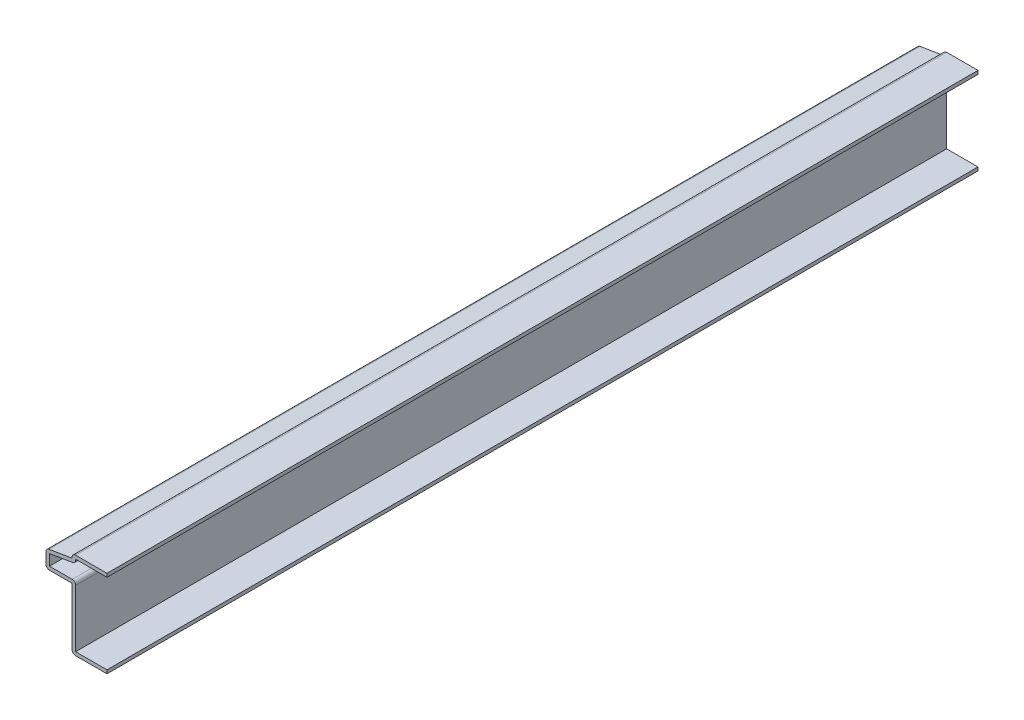
ISO-10303-21;
HEADER;
FILE_DESCRIPTION(('STEP AP214'),'2;1');
FILE_NAME('part.step','',(''),(''),'','','');
FILE_SCHEMA(('AUTOMOTIVE_DESIGN { 1 0 10303 214 1 1 1 1 }'));
ENDSEC;
DATA;
#1=APPLICATION_CONTEXT('core data for automotive mechanical design processes');
#2=APPLICATION_PROTOCOL_DEFINITION('international standard','automotive_design',2000,#1);
#3=PRODUCT_CONTEXT('',#1,'mechanical');
#4=PRODUCT('Part','Part','',(#3));
#5=PRODUCT_RELATED_PRODUCT_CATEGORY('part','',(#4));
#6=PRODUCT_DEFINITION_FORMATION('','',#4);
#7=PRODUCT_DEFINITION_CONTEXT('part definition',#1,'design');
#8=PRODUCT_DEFINITION('design','',#6,#7);
#9=PRODUCT_DEFINITION_SHAPE('','',#8);
#10=(LENGTH_UNIT() NAMED_UNIT(*) SI_UNIT(.MILLI.,.METRE.));
#11=(NAMED_UNIT(*) PLANE_ANGLE_UNIT() SI_UNIT($,.RADIAN.));
#12=(NAMED_UNIT(*) SI_UNIT($,.STERADIAN.) SOLID_ANGLE_UNIT());
#13=UNCERTAINTY_MEASURE_WITH_UNIT(LENGTH_MEASURE(1.E-05),#10,'distance_accuracy_value','');
#14=(GEOMETRIC_REPRESENTATION_CONTEXT(3) GLOBAL_UNCERTAINTY_ASSIGNED_CONTEXT((#13)) GLOBAL_UNIT_ASSIGNED_CONTEXT((#10,
#11,#12)) REPRESENTATION_CONTEXT('',''));
#15=CARTESIAN_POINT('',(0.,0.,0.));
#16=DIRECTION('',(0.,0.,1.));
#17=DIRECTION('',(1.,0.,0.));
#18=AXIS2_PLACEMENT_3D('',#15,#16,#17);
#19=CARTESIAN_POINT('',(-12.7,30.48,-317.5));
#20=DIRECTION('',(0.,-1.,0.));
#21=DIRECTION('',(0.,0.,-1.));
#22=AXIS2_PLACEMENT_3D('',#19,#20,#21);
#23=PLANE('',#22);
#24=DIRECTION('',(1.,0.,0.));
#25=VECTOR('',#24,1.);
#26=CARTESIAN_POINT('',(-12.7,30.48,0.));
#27=LINE('',#26,#25);
#28=CARTESIAN_POINT('',(-11.43,30.48,0.));
#29=VERTEX_POINT('',#28);
#30=CARTESIAN_POINT('',(0.,30.48,0.));
#31=VERTEX_POINT('',#30);
#32=EDGE_CURVE('E246',#29,#31,#27,.T.);
#33=ORIENTED_EDGE('',*,*,#32,.F.);
#34=DIRECTION('',(0.,0.,1.));
#35=VECTOR('',#34,1.);
#36=CARTESIAN_POINT('',(-11.43,30.48,-317.5));
#37=LINE('',#36,#35);
#38=CARTESIAN_POINT('',(-11.43,30.48,-317.5));
#39=VERTEX_POINT('',#38);
#40=EDGE_CURVE('E208',#39,#29,#37,.T.);
#41=ORIENTED_EDGE('',*,*,#40,.F.);
#42=DIRECTION('',(1.,0.,0.));
#43=VECTOR('',#42,1.);
#44=CARTESIAN_POINT('',(-12.7,30.48,-317.5));
#45=LINE('',#44,#43);
#46=CARTESIAN_POINT('',(0.,30.48,-317.5));
#47=VERTEX_POINT('',#46);
#48=EDGE_CURVE('E189',#39,#47,#45,.T.);
#49=ORIENTED_EDGE('',*,*,#48,.T.);
#50=DIRECTION('',(0.,0.,1.));
#51=VECTOR('',#50,1.);
#52=CARTESIAN_POINT('',(0.,30.48,-317.5));
#53=LINE('',#52,#51);
#54=EDGE_CURVE('E196',#47,#31,#53,.T.);
#55=ORIENTED_EDGE('',*,*,#54,.T.);
#56=EDGE_LOOP('',(#33,#41,#49,#55));
#57=FACE_BOUND('',#56,.T.);
#58=ADVANCED_FACE('F35',(#57),#23,.T.);
#59=CARTESIAN_POINT('',(-11.43,30.1625,-317.5));
#60=DIRECTION('',(1.,0.,0.));
#61=DIRECTION('',(0.,0.,-1.));
#62=AXIS2_PLACEMENT_3D('',#59,#60,#61);
#63=PLANE('',#62);
#64=DIRECTION('',(0.,1.,0.));
#65=VECTOR('',#64,1.);
#66=CARTESIAN_POINT('',(-11.43,30.1625,0.));
#67=LINE('',#66,#65);
#68=CARTESIAN_POINT('',(-11.43,30.1625,0.));
#69=VERTEX_POINT('',#68);
#70=EDGE_CURVE('E209',#69,#29,#67,.T.);
#71=ORIENTED_EDGE('',*,*,#70,.F.);
#72=DIRECTION('',(0.,0.,1.));
#73=VECTOR('',#72,1.);
#74=CARTESIAN_POINT('',(-11.43,30.1625,-317.5));
#75=LINE('',#74,#73);
#76=CARTESIAN_POINT('',(-11.43,30.1625,-317.5));
#77=VERTEX_POINT('',#76);
#78=EDGE_CURVE('E344',#69,#77,#75,.F.);
#79=ORIENTED_EDGE('',*,*,#78,.T.);
#80=DIRECTION('',(0.,1.,0.));
#81=VECTOR('',#80,1.);
#82=CARTESIAN_POINT('',(-11.43,30.1625,-317.5));
#83=LINE('',#82,#81);
#84=EDGE_CURVE('E204',#77,#39,#83,.T.);
#85=ORIENTED_EDGE('',*,*,#84,.T.);
#86=ORIENTED_EDGE('',*,*,#40,.T.);
#87=EDGE_LOOP('',(#71,#79,#85,#86));
#88=FACE_BOUND('',#87,.T.);
#89=ADVANCED_FACE('F361',(#88),#63,.T.);
#90=CARTESIAN_POINT('',(-22.0162132861222,27.3222797167332,-317.5));
#91=DIRECTION('',(0.164398987305358,-0.986393923832144,0.));
#92=DIRECTION('',(0.986393923832144,0.164398987305358,0.));
#93=AXIS2_PLACEMENT_3D('',#90,#91,#92);
#94=PLANE('',#93);
#95=DIRECTION('',(0.986393923832144,0.164398987305358,0.));
#96=VECTOR('',#95,1.);
#97=CARTESIAN_POINT('',(-22.0162132861222,27.3222797167332,-317.5));
#98=LINE('',#97,#96);
#99=CARTESIAN_POINT('',(-20.955,27.4991485977535,-317.5));
#100=VERTEX_POINT('',#99);
#101=CARTESIAN_POINT('',(-12.4912132861222,28.9097797167332,-317.5));
#102=VERTEX_POINT('',#101);
#103=EDGE_CURVE('E242',#100,#102,#98,.T.);
#104=ORIENTED_EDGE('',*,*,#103,.T.);
#105=DIRECTION('',(0.,0.,1.));
#106=VECTOR('',#105,1.);
#107=CARTESIAN_POINT('',(-12.4912132861222,28.9097797167332,-317.5));
#108=LINE('',#107,#106);
#109=CARTESIAN_POINT('',(-12.4912132861222,28.9097797167332,0.));
#110=VERTEX_POINT('',#109);
#111=EDGE_CURVE('E341',#102,#110,#108,.T.);
#112=ORIENTED_EDGE('',*,*,#111,.T.);
#113=DIRECTION('',(0.986393923832144,0.164398987305358,0.));
#114=VECTOR('',#113,1.);
#115=CARTESIAN_POINT('',(-22.0162132861222,27.3222797167332,0.));
#116=LINE('',#115,#114);
#117=CARTESIAN_POINT('',(-20.955,27.4991485977535,0.));
#118=VERTEX_POINT('',#117);
#119=EDGE_CURVE('E211',#118,#110,#116,.T.);
#120=ORIENTED_EDGE('',*,*,#119,.F.);
#121=DIRECTION('',(0.,0.,1.));
#122=VECTOR('',#121,1.);
#123=CARTESIAN_POINT('',(-20.955,27.4991485977535,-317.5));
#124=LINE('',#123,#122);
#125=EDGE_CURVE('E283',#100,#118,#124,.T.);
#126=ORIENTED_EDGE('',*,*,#125,.F.);
#127=EDGE_LOOP('',(#104,#112,#120,#126));
#128=FACE_BOUND('',#127,.T.);
#129=ADVANCED_FACE('F369',(#128),#94,.T.);
#130=CARTESIAN_POINT('',(-20.955,22.225,-317.5));
#131=DIRECTION('',(1.,0.,0.));
#132=DIRECTION('',(0.,0.,-1.));
#133=AXIS2_PLACEMENT_3D('',#130,#131,#132);
#134=PLANE('',#133);
#135=DIRECTION('',(0.,1.,0.));
#136=VECTOR('',#135,1.);
#137=CARTESIAN_POINT('',(-20.955,22.225,0.));
#138=LINE('',#137,#136);
#139=CARTESIAN_POINT('',(-20.955,23.495,0.));
#140=VERTEX_POINT('',#139);
#141=EDGE_CURVE('E276',#140,#118,#138,.T.);
#142=ORIENTED_EDGE('',*,*,#141,.F.);
#143=DIRECTION('',(0.,0.,1.));
#144=VECTOR('',#143,1.);
#145=CARTESIAN_POINT('',(-20.955,23.495,-317.5));
#146=LINE('',#145,#144);
#147=CARTESIAN_POINT('',(-20.955,23.495,-317.5));
#148=VERTEX_POINT('',#147);
#149=EDGE_CURVE('E285',#148,#140,#146,.T.);
#150=ORIENTED_EDGE('',*,*,#149,.F.);
#151=DIRECTION('',(0.,1.,0.));
#152=VECTOR('',#151,1.);
#153=CARTESIAN_POINT('',(-20.955,22.225,-317.5));
#154=LINE('',#153,#152);
#155=EDGE_CURVE('E239',#148,#100,#154,.T.);
#156=ORIENTED_EDGE('',*,*,#155,.T.);
#157=ORIENTED_EDGE('',*,*,#125,.T.);
#158=EDGE_LOOP('',(#142,#150,#156,#157));
#159=FACE_BOUND('',#158,.T.);
#160=ADVANCED_FACE('F374',(#159),#134,.T.);
#161=CARTESIAN_POINT('',(-12.7,23.495,-317.5));
#162=DIRECTION('',(0.,1.,0.));
#163=DIRECTION('',(0.,0.,1.));
#164=AXIS2_PLACEMENT_3D('',#161,#162,#163);
#165=PLANE('',#164);
#166=DIRECTION('',(1.,0.,0.));
#167=VECTOR('',#166,1.);
#168=CARTESIAN_POINT('',(-12.7,23.495,0.));
#169=LINE('',#168,#167);
#170=CARTESIAN_POINT('',(-12.7,23.495,0.));
#171=VERTEX_POINT('',#170);
#172=EDGE_CURVE('E274',#171,#140,#169,.F.);
#173=ORIENTED_EDGE('',*,*,#172,.F.);
#174=DIRECTION('',(0.,0.,1.));
#175=VECTOR('',#174,1.);
#176=CARTESIAN_POINT('',(-12.7,23.495,-317.5));
#177=LINE('',#176,#175);
#178=CARTESIAN_POINT('',(-12.7,23.495,-317.5));
#179=VERTEX_POINT('',#178);
#180=EDGE_CURVE('E339',#171,#179,#177,.F.);
#181=ORIENTED_EDGE('',*,*,#180,.T.);
#182=DIRECTION('',(1.,0.,0.));
#183=VECTOR('',#182,1.);
#184=CARTESIAN_POINT('',(-12.7,23.495,-317.5));
#185=LINE('',#184,#183);
#186=EDGE_CURVE('E237',#179,#148,#185,.F.);
#187=ORIENTED_EDGE('',*,*,#186,.T.);
#188=ORIENTED_EDGE('',*,*,#149,.T.);
#189=EDGE_LOOP('',(#173,#181,#187,#188));
#190=FACE_BOUND('',#189,.T.);
#191=ADVANCED_FACE('F576',(#190),#165,.T.);
#192=CARTESIAN_POINT('',(-11.43,0.,-317.5));
#193=DIRECTION('',(1.,0.,0.));
#194=DIRECTION('',(0.,0.,-1.));
#195=AXIS2_PLACEMENT_3D('',#192,#193,#194);
#196=PLANE('',#195);
#197=DIRECTION('',(0.,1.,0.));
#198=VECTOR('',#197,1.);
#199=CARTESIAN_POINT('',(-11.43,0.,-317.5));
#200=LINE('',#199,#198);
#201=CARTESIAN_POINT('',(-11.43,1.27,-317.5));
#202=VERTEX_POINT('',#201);
#203=CARTESIAN_POINT('',(-11.43,22.225,-317.5));
#204=VERTEX_POINT('',#203);
#205=EDGE_CURVE('E234',#202,#204,#200,.T.);
#206=ORIENTED_EDGE('',*,*,#205,.T.);
#207=DIRECTION('',(0.,0.,1.));
#208=VECTOR('',#207,1.);
#209=CARTESIAN_POINT('',(-11.43,22.225,-317.5));
#210=LINE('',#209,#208);
#211=CARTESIAN_POINT('',(-11.43,22.225,0.));
#212=VERTEX_POINT('',#211);
#213=EDGE_CURVE('E336',#204,#212,#210,.T.);
#214=ORIENTED_EDGE('',*,*,#213,.T.);
#215=DIRECTION('',(0.,1.,0.));
#216=VECTOR('',#215,1.);
#217=CARTESIAN_POINT('',(-11.43,0.,0.));
#218=LINE('',#217,#216);
#219=CARTESIAN_POINT('',(-11.43,1.27,0.));
#220=VERTEX_POINT('',#219);
#221=EDGE_CURVE('E271',#220,#212,#218,.T.);
#222=ORIENTED_EDGE('',*,*,#221,.F.);
#223=DIRECTION('',(0.,0.,1.));
#224=VECTOR('',#223,1.);
#225=CARTESIAN_POINT('',(-11.43,1.27,-317.5));
#226=LINE('',#225,#224);
#227=EDGE_CURVE('E288',#202,#220,#226,.T.);
#228=ORIENTED_EDGE('',*,*,#227,.F.);
#229=EDGE_LOOP('',(#206,#214,#222,#228));
#230=FACE_BOUND('',#229,.T.);
#231=ADVANCED_FACE('F386',(#230),#196,.T.);
#232=CARTESIAN_POINT('',(0.,1.27,-317.5));
#233=DIRECTION('',(0.,1.,0.));
#234=DIRECTION('',(-1.,0.,0.));
#235=AXIS2_PLACEMENT_3D('',#232,#233,#234);
#236=PLANE('',#235);
#237=DIRECTION('',(-1.,0.,0.));
#238=VECTOR('',#237,1.);
#239=CARTESIAN_POINT('',(0.,1.27,0.));
#240=LINE('',#239,#238);
#241=CARTESIAN_POINT('',(0.,1.27,0.));
#242=VERTEX_POINT('',#241);
#243=EDGE_CURVE('E268',#242,#220,#240,.T.);
#244=ORIENTED_EDGE('',*,*,#243,.F.);
#245=DIRECTION('',(0.,0.,1.));
#246=VECTOR('',#245,1.);
#247=CARTESIAN_POINT('',(0.,1.27,-317.5));
#248=LINE('',#247,#246);
#249=CARTESIAN_POINT('',(0.,1.27,-317.5));
#250=VERTEX_POINT('',#249);
#251=EDGE_CURVE('E290',#250,#242,#248,.T.);
#252=ORIENTED_EDGE('',*,*,#251,.F.);
#253=DIRECTION('',(-1.,0.,0.));
#254=VECTOR('',#253,1.);
#255=CARTESIAN_POINT('',(0.,1.27,-317.5));
#256=LINE('',#255,#254);
#257=EDGE_CURVE('E231',#250,#202,#256,.T.);
#258=ORIENTED_EDGE('',*,*,#257,.T.);
#259=ORIENTED_EDGE('',*,*,#227,.T.);
#260=EDGE_LOOP('',(#244,#252,#258,#259));
#261=FACE_BOUND('',#260,.T.);
#262=ADVANCED_FACE('F391',(#261),#236,.T.);
#263=CARTESIAN_POINT('',(0.,1.27,-317.5));
#264=DIRECTION('',(-1.,0.,0.));
#265=DIRECTION('',(0.,-1.,0.));
#266=AXIS2_PLACEMENT_3D('',#263,#264,#265);
#267=PLANE('',#266);
#268=DIRECTION('',(0.,-1.,0.));
#269=VECTOR('',#268,1.);
#270=CARTESIAN_POINT('',(0.,1.27,0.));
#271=LINE('',#270,#269);
#272=CARTESIAN_POINT('',(0.,0.,0.));
#273=VERTEX_POINT('',#272);
#274=EDGE_CURVE('E266',#242,#273,#271,.T.);
#275=ORIENTED_EDGE('',*,*,#274,.T.);
#276=DIRECTION('',(0.,0.,1.));
#277=VECTOR('',#276,1.);
#278=CARTESIAN_POINT('',(0.,0.,-317.5));
#279=LINE('',#278,#277);
#280=CARTESIAN_POINT('',(0.,0.,-317.5));
#281=VERTEX_POINT('',#280);
#282=EDGE_CURVE('E292',#281,#273,#279,.T.);
#283=ORIENTED_EDGE('',*,*,#282,.F.);
#284=DIRECTION('',(0.,-1.,0.));
#285=VECTOR('',#284,1.);
#286=CARTESIAN_POINT('',(0.,1.27,-317.5));
#287=LINE('',#286,#285);
#288=EDGE_CURVE('E229',#250,#281,#287,.T.);
#289=ORIENTED_EDGE('',*,*,#288,.F.);
#290=ORIENTED_EDGE('',*,*,#251,.T.);
#291=EDGE_LOOP('',(#275,#283,#289,#290));
#292=FACE_BOUND('',#291,.T.);
#293=ADVANCED_FACE('F398',(#292),#267,.F.);
#294=CARTESIAN_POINT('',(0.,0.,-317.5));
#295=DIRECTION('',(0.,1.,0.));
#296=DIRECTION('',(-1.,0.,0.));
#297=AXIS2_PLACEMENT_3D('',#294,#295,#296);
#298=PLANE('',#297);
#299=DIRECTION('',(-1.,0.,0.));
#300=VECTOR('',#299,1.);
#301=CARTESIAN_POINT('',(0.,0.,0.));
#302=LINE('',#301,#300);
#303=CARTESIAN_POINT('',(-11.43,0.,0.));
#304=VERTEX_POINT('',#303);
#305=EDGE_CURVE('E263',#273,#304,#302,.T.);
#306=ORIENTED_EDGE('',*,*,#305,.T.);
#307=DIRECTION('',(0.,0.,1.));
#308=VECTOR('',#307,1.);
#309=CARTESIAN_POINT('',(-11.43,0.,-317.5));
#310=LINE('',#309,#308);
#311=CARTESIAN_POINT('',(-11.43,0.,-317.5));
#312=VERTEX_POINT('',#311);
#313=EDGE_CURVE('E316',#304,#312,#310,.F.);
#314=ORIENTED_EDGE('',*,*,#313,.T.);
#315=DIRECTION('',(-1.,0.,0.));
#316=VECTOR('',#315,1.);
#317=CARTESIAN_POINT('',(0.,0.,-317.5));
#318=LINE('',#317,#316);
#319=EDGE_CURVE('E227',#281,#312,#318,.T.);
#320=ORIENTED_EDGE('',*,*,#319,.F.);
#321=ORIENTED_EDGE('',*,*,#282,.T.);
#322=EDGE_LOOP('',(#306,#314,#320,#321));
#323=FACE_BOUND('',#322,.T.);
#324=ADVANCED_FACE('F400',(#323),#298,.F.);
#325=CARTESIAN_POINT('',(-12.7,0.,-317.5));
#326=DIRECTION('',(1.,0.,0.));
#327=DIRECTION('',(0.,0.,-1.));
#328=AXIS2_PLACEMENT_3D('',#325,#326,#327);
#329=PLANE('',#328);
#330=DIRECTION('',(0.,1.,0.));
#331=VECTOR('',#330,1.);
#332=CARTESIAN_POINT('',(-12.7,0.,-317.5));
#333=LINE('',#332,#331);
#334=CARTESIAN_POINT('',(-12.7,1.27,-317.5));
#335=VERTEX_POINT('',#334);
#336=CARTESIAN_POINT('',(-12.7,22.225,-317.5));
#337=VERTEX_POINT('',#336);
#338=EDGE_CURVE('E225',#335,#337,#333,.T.);
#339=ORIENTED_EDGE('',*,*,#338,.F.);
#340=DIRECTION('',(0.,0.,1.));
#341=VECTOR('',#340,1.);
#342=CARTESIAN_POINT('',(-12.7,1.27,-317.5));
#343=LINE('',#342,#341);
#344=CARTESIAN_POINT('',(-12.7,1.27,0.));
#345=VERTEX_POINT('',#344);
#346=EDGE_CURVE('E282',#335,#345,#343,.T.);
#347=ORIENTED_EDGE('',*,*,#346,.T.);
#348=DIRECTION('',(0.,1.,0.));
#349=VECTOR('',#348,1.);
#350=CARTESIAN_POINT('',(-12.7,0.,0.));
#351=LINE('',#350,#349);
#352=CARTESIAN_POINT('',(-12.7,22.225,0.));
#353=VERTEX_POINT('',#352);
#354=EDGE_CURVE('E261',#345,#353,#351,.T.);
#355=ORIENTED_EDGE('',*,*,#354,.T.);
#356=DIRECTION('',(0.,0.,1.));
#357=VECTOR('',#356,1.);
#358=CARTESIAN_POINT('',(-12.7,22.225,-317.5));
#359=LINE('',#358,#357);
#360=EDGE_CURVE('E295',#337,#353,#359,.T.);
#361=ORIENTED_EDGE('',*,*,#360,.F.);
#362=EDGE_LOOP('',(#339,#347,#355,#361));
#363=FACE_BOUND('',#362,.T.);
#364=ADVANCED_FACE('F408',(#363),#329,.F.);
#365=CARTESIAN_POINT('',(-12.7,22.225,-317.5));
#366=DIRECTION('',(0.,1.,0.));
#367=DIRECTION('',(0.,0.,1.));
#368=AXIS2_PLACEMENT_3D('',#365,#366,#367);
#369=PLANE('',#368);
#370=DIRECTION('',(-1.,0.,0.));
#371=VECTOR('',#370,1.);
#372=CARTESIAN_POINT('',(-12.7,22.225,0.));
#373=LINE('',#372,#371);
#374=CARTESIAN_POINT('',(-20.955,22.225,0.));
#375=VERTEX_POINT('',#374);
#376=EDGE_CURVE('E258',#353,#375,#373,.T.);
#377=ORIENTED_EDGE('',*,*,#376,.T.);
#378=DIRECTION('',(0.,0.,1.));
#379=VECTOR('',#378,1.);
#380=CARTESIAN_POINT('',(-20.955,22.225,-317.5));
#381=LINE('',#380,#379);
#382=CARTESIAN_POINT('',(-20.955,22.225,-317.5));
#383=VERTEX_POINT('',#382);
#384=EDGE_CURVE('E334',#375,#383,#381,.F.);
#385=ORIENTED_EDGE('',*,*,#384,.T.);
#386=DIRECTION('',(-1.,0.,0.));
#387=VECTOR('',#386,1.);
#388=CARTESIAN_POINT('',(-12.7,22.225,-317.5));
#389=LINE('',#388,#387);
#390=EDGE_CURVE('E222',#337,#383,#389,.T.);
#391=ORIENTED_EDGE('',*,*,#390,.F.);
#392=ORIENTED_EDGE('',*,*,#360,.T.);
#393=EDGE_LOOP('',(#377,#385,#391,#392));
#394=FACE_BOUND('',#393,.T.);
#395=ADVANCED_FACE('F412',(#394),#369,.F.);
#396=CARTESIAN_POINT('',(-22.225,22.225,-317.5));
#397=DIRECTION('',(1.,0.,0.));
#398=DIRECTION('',(0.,0.,-1.));
#399=AXIS2_PLACEMENT_3D('',#396,#397,#398);
#400=PLANE('',#399);
#401=DIRECTION('',(0.,1.,0.));
#402=VECTOR('',#401,1.);
#403=CARTESIAN_POINT('',(-22.225,22.225,-317.5));
#404=LINE('',#403,#402);
#405=CARTESIAN_POINT('',(-22.225,23.495,-317.5));
#406=VERTEX_POINT('',#405);
#407=CARTESIAN_POINT('',(-22.225,27.4991485977535,-317.5));
#408=VERTEX_POINT('',#407);
#409=EDGE_CURVE('E219',#406,#408,#404,.T.);
#410=ORIENTED_EDGE('',*,*,#409,.F.);
#411=DIRECTION('',(0.,0.,1.));
#412=VECTOR('',#411,1.);
#413=CARTESIAN_POINT('',(-22.225,23.495,-317.5));
#414=LINE('',#413,#412);
#415=CARTESIAN_POINT('',(-22.225,23.495,0.));
#416=VERTEX_POINT('',#415);
#417=EDGE_CURVE('E331',#406,#416,#414,.T.);
#418=ORIENTED_EDGE('',*,*,#417,.T.);
#419=DIRECTION('',(0.,1.,0.));
#420=VECTOR('',#419,1.);
#421=CARTESIAN_POINT('',(-22.225,22.225,0.));
#422=LINE('',#421,#420);
#423=CARTESIAN_POINT('',(-22.225,27.4991485977535,0.));
#424=VERTEX_POINT('',#423);
#425=EDGE_CURVE('E255',#416,#424,#422,.T.);
#426=ORIENTED_EDGE('',*,*,#425,.T.);
#427=DIRECTION('',(0.,0.,1.));
#428=VECTOR('',#427,1.);
#429=CARTESIAN_POINT('',(-22.225,27.4991485977535,-317.5));
#430=LINE('',#429,#428);
#431=EDGE_CURVE('E329',#424,#408,#430,.F.);
#432=ORIENTED_EDGE('',*,*,#431,.T.);
#433=EDGE_LOOP('',(#410,#418,#426,#432));
#434=FACE_BOUND('',#433,.T.);
#435=ADVANCED_FACE('F421',(#434),#400,.F.);
#436=CARTESIAN_POINT('',(-22.225,28.575,-317.5));
#437=DIRECTION('',(0.164398987305358,-0.986393923832144,0.));
#438=DIRECTION('',(0.986393923832144,0.164398987305358,0.));
#439=AXIS2_PLACEMENT_3D('',#436,#437,#438);
#440=PLANE('',#439);
#441=DIRECTION('',(0.986393923832144,0.164398987305358,0.));
#442=VECTOR('',#441,1.);
#443=CARTESIAN_POINT('',(-22.225,28.575,-317.5));
#444=LINE('',#443,#442);
#445=CARTESIAN_POINT('',(-21.1637867138778,28.7518688810204,-317.5));
#446=VERTEX_POINT('',#445);
#447=CARTESIAN_POINT('',(-12.7,30.1625,-317.5));
#448=VERTEX_POINT('',#447);
#449=EDGE_CURVE('E217',#446,#448,#444,.T.);
#450=ORIENTED_EDGE('',*,*,#449,.F.);
#451=DIRECTION('',(0.,0.,1.));
#452=VECTOR('',#451,1.);
#453=CARTESIAN_POINT('',(-21.1637867138778,28.7518688810204,-317.5));
#454=LINE('',#453,#452);
#455=CARTESIAN_POINT('',(-21.1637867138778,28.7518688810204,0.));
#456=VERTEX_POINT('',#455);
#457=EDGE_CURVE('E346',#446,#456,#454,.T.);
#458=ORIENTED_EDGE('',*,*,#457,.T.);
#459=DIRECTION('',(0.986393923832144,0.164398987305358,0.));
#460=VECTOR('',#459,1.);
#461=CARTESIAN_POINT('',(-22.225,28.575,0.));
#462=LINE('',#461,#460);
#463=CARTESIAN_POINT('',(-12.7,30.1625,0.));
#464=VERTEX_POINT('',#463);
#465=EDGE_CURVE('E253',#456,#464,#462,.T.);
#466=ORIENTED_EDGE('',*,*,#465,.T.);
#467=DIRECTION('',(0.,0.,1.));
#468=VECTOR('',#467,1.);
#469=CARTESIAN_POINT('',(-12.7,30.1625,-317.5));
#470=LINE('',#469,#468);
#471=EDGE_CURVE('E298',#448,#464,#470,.T.);
#472=ORIENTED_EDGE('',*,*,#471,.F.);
#473=EDGE_LOOP('',(#450,#458,#466,#472));
#474=FACE_BOUND('',#473,.T.);
#475=ADVANCED_FACE('F430',(#474),#440,.F.);
#476=CARTESIAN_POINT('',(-12.7,30.1625,-317.5));
#477=DIRECTION('',(1.,0.,0.));
#478=DIRECTION('',(0.,0.,-1.));
#479=AXIS2_PLACEMENT_3D('',#476,#477,#478);
#480=PLANE('',#479);
#481=DIRECTION('',(0.,1.,0.));
#482=VECTOR('',#481,1.);
#483=CARTESIAN_POINT('',(-12.7,30.1625,0.));
#484=LINE('',#483,#482);
#485=CARTESIAN_POINT('',(-12.7,30.48,0.));
#486=VERTEX_POINT('',#485);
#487=EDGE_CURVE('E251',#464,#486,#484,.T.);
#488=ORIENTED_EDGE('',*,*,#487,.T.);
#489=DIRECTION('',(0.,0.,1.));
#490=VECTOR('',#489,1.);
#491=CARTESIAN_POINT('',(-12.7,30.48,-317.5));
#492=LINE('',#491,#490);
#493=CARTESIAN_POINT('',(-12.7,30.48,-317.5));
#494=VERTEX_POINT('',#493);
#495=EDGE_CURVE('E11',#486,#494,#492,.F.);
#496=ORIENTED_EDGE('',*,*,#495,.T.);
#497=DIRECTION('',(0.,1.,0.));
#498=VECTOR('',#497,1.);
#499=CARTESIAN_POINT('',(-12.7,30.1625,-317.5));
#500=LINE('',#499,#498);
#501=EDGE_CURVE('E215',#448,#494,#500,.T.);
#502=ORIENTED_EDGE('',*,*,#501,.F.);
#503=ORIENTED_EDGE('',*,*,#471,.T.);
#504=EDGE_LOOP('',(#488,#496,#502,#503));
#505=FACE_BOUND('',#504,.T.);
#506=ADVANCED_FACE('F513',(#505),#480,.F.);
#507=CARTESIAN_POINT('',(-12.7,31.75,-317.5));
#508=DIRECTION('',(0.,-1.,0.));
#509=DIRECTION('',(0.,0.,-1.));
#510=AXIS2_PLACEMENT_3D('',#507,#508,#509);
#511=PLANE('',#510);
#512=DIRECTION('',(1.,0.,0.));
#513=VECTOR('',#512,1.);
#514=CARTESIAN_POINT('',(-12.7,31.75,-317.5));
#515=LINE('',#514,#513);
#516=CARTESIAN_POINT('',(-11.43,31.75,-317.5));
#517=VERTEX_POINT('',#516);
#518=CARTESIAN_POINT('',(0.,31.75,-317.5));
#519=VERTEX_POINT('',#518);
#520=EDGE_CURVE('E190',#517,#519,#515,.T.);
#521=ORIENTED_EDGE('',*,*,#520,.F.);
#522=DIRECTION('',(0.,0.,1.));
#523=VECTOR('',#522,1.);
#524=CARTESIAN_POINT('',(-11.43,31.75,-317.5));
#525=LINE('',#524,#523);
#526=CARTESIAN_POINT('',(-11.43,31.75,0.));
#527=VERTEX_POINT('',#526);
#528=EDGE_CURVE('E43',#517,#527,#525,.T.);
#529=ORIENTED_EDGE('',*,*,#528,.T.);
#530=DIRECTION('',(1.,0.,0.));
#531=VECTOR('',#530,1.);
#532=CARTESIAN_POINT('',(-12.7,31.75,0.));
#533=LINE('',#532,#531);
#534=CARTESIAN_POINT('',(0.,31.75,0.));
#535=VERTEX_POINT('',#534);
#536=EDGE_CURVE('E249',#527,#535,#533,.T.);
#537=ORIENTED_EDGE('',*,*,#536,.T.);
#538=DIRECTION('',(0.,0.,1.));
#539=VECTOR('',#538,1.);
#540=CARTESIAN_POINT('',(0.,31.75,-317.5));
#541=LINE('',#540,#539);
#542=EDGE_CURVE('E203',#519,#535,#541,.T.);
#543=ORIENTED_EDGE('',*,*,#542,.F.);
#544=EDGE_LOOP('',(#521,#529,#537,#543));
#545=FACE_BOUND('',#544,.T.);
#546=ADVANCED_FACE('F352',(#545),#511,.F.);
#547=CARTESIAN_POINT('',(0.,31.75,-317.5));
#548=DIRECTION('',(-1.,0.,0.));
#549=DIRECTION('',(0.,0.,1.));
#550=AXIS2_PLACEMENT_3D('',#547,#548,#549);
#551=PLANE('',#550);
#552=DIRECTION('',(0.,-1.,0.));
#553=VECTOR('',#552,1.);
#554=CARTESIAN_POINT('',(0.,31.75,0.));
#555=LINE('',#554,#553);
#556=EDGE_CURVE('E199',#535,#31,#555,.T.);
#557=ORIENTED_EDGE('',*,*,#556,.T.);
#558=ORIENTED_EDGE('',*,*,#54,.F.);
#559=DIRECTION('',(0.,-1.,0.));
#560=VECTOR('',#559,1.);
#561=CARTESIAN_POINT('',(0.,31.75,-317.5));
#562=LINE('',#561,#560);
#563=EDGE_CURVE('E183',#519,#47,#562,.T.);
#564=ORIENTED_EDGE('',*,*,#563,.F.);
#565=ORIENTED_EDGE('',*,*,#542,.T.);
#566=EDGE_LOOP('',(#557,#558,#564,#565));
#567=FACE_BOUND('',#566,.T.);
#568=ADVANCED_FACE('F197',(#567),#551,.F.);
#569=CARTESIAN_POINT('',(0.,0.,-317.5));
#570=DIRECTION('',(0.,0.,-1.));
#571=DIRECTION('',(-1.,0.,0.));
#572=AXIS2_PLACEMENT_3D('',#569,#570,#571);
#573=PLANE('',#572);
#574=ORIENTED_EDGE('',*,*,#319,.T.);
#575=CARTESIAN_POINT('',(-11.43,1.27,-317.5));
#576=DIRECTION('',(0.,0.,-1.));
#577=DIRECTION('',(-1.,0.,0.));
#578=AXIS2_PLACEMENT_3D('',#575,#576,#577);
#579=CIRCLE('',#578,1.27);
#580=EDGE_CURVE('E327',#312,#335,#579,.T.);
#581=ORIENTED_EDGE('',*,*,#580,.T.);
#582=ORIENTED_EDGE('',*,*,#338,.T.);
#583=ORIENTED_EDGE('',*,*,#390,.T.);
#584=CARTESIAN_POINT('',(-20.955,23.495,-317.5));
#585=DIRECTION('',(0.,0.,-1.));
#586=DIRECTION('',(-1.,0.,0.));
#587=AXIS2_PLACEMENT_3D('',#584,#585,#586);
#588=CIRCLE('',#587,1.27);
#589=EDGE_CURVE('E325',#383,#406,#588,.T.);
#590=ORIENTED_EDGE('',*,*,#589,.T.);
#591=ORIENTED_EDGE('',*,*,#409,.T.);
#592=CARTESIAN_POINT('',(-20.955,27.4991485977535,-317.5));
#593=DIRECTION('',(0.,0.,-1.));
#594=DIRECTION('',(-1.,0.,0.));
#595=AXIS2_PLACEMENT_3D('',#592,#593,#594);
#596=CIRCLE('',#595,1.27);
#597=EDGE_CURVE('E319',#408,#446,#596,.T.);
#598=ORIENTED_EDGE('',*,*,#597,.T.);
#599=ORIENTED_EDGE('',*,*,#449,.T.);
#600=ORIENTED_EDGE('',*,*,#501,.T.);
#601=CARTESIAN_POINT('',(-11.43,30.48,-317.5));
#602=DIRECTION('',(0.,0.,-1.));
#603=DIRECTION('',(-1.,0.,0.));
#604=AXIS2_PLACEMENT_3D('',#601,#602,#603);
#605=CIRCLE('',#604,1.27);
#606=EDGE_CURVE('E50',#494,#517,#605,.T.);
#607=ORIENTED_EDGE('',*,*,#606,.T.);
#608=ORIENTED_EDGE('',*,*,#520,.T.);
#609=ORIENTED_EDGE('',*,*,#563,.T.);
#610=ORIENTED_EDGE('',*,*,#48,.F.);
#611=ORIENTED_EDGE('',*,*,#84,.F.);
#612=CARTESIAN_POINT('',(-12.7,30.1625,-317.5));
#613=DIRECTION('',(0.,0.,-1.));
#614=DIRECTION('',(-1.,0.,0.));
#615=AXIS2_PLACEMENT_3D('',#612,#613,#614);
#616=CIRCLE('',#615,1.27);
#617=EDGE_CURVE('E321',#77,#102,#616,.T.);
#618=ORIENTED_EDGE('',*,*,#617,.T.);
#619=ORIENTED_EDGE('',*,*,#103,.F.);
#620=ORIENTED_EDGE('',*,*,#155,.F.);
#621=ORIENTED_EDGE('',*,*,#186,.F.);
#622=CARTESIAN_POINT('',(-12.7,22.225,-317.5));
#623=DIRECTION('',(0.,0.,-1.));
#624=DIRECTION('',(-1.,0.,0.));
#625=AXIS2_PLACEMENT_3D('',#622,#623,#624);
#626=CIRCLE('',#625,1.27);
#627=EDGE_CURVE('E323',#179,#204,#626,.T.);
#628=ORIENTED_EDGE('',*,*,#627,.T.);
#629=ORIENTED_EDGE('',*,*,#205,.F.);
#630=ORIENTED_EDGE('',*,*,#257,.F.);
#631=ORIENTED_EDGE('',*,*,#288,.T.);
#632=EDGE_LOOP('',(#574,#581,#582,#583,#590,#591,#598,#599,#600,#607,#608,#609,#610,#611,#618,
#619,#620,#621,#628,#629,#630,#631));
#633=FACE_BOUND('',#632,.T.);
#634=ADVANCED_FACE('F186',(#633),#573,.T.);
#635=CARTESIAN_POINT('',(0.,0.,0.));
#636=DIRECTION('',(0.,0.,-1.));
#637=DIRECTION('',(-1.,0.,0.));
#638=AXIS2_PLACEMENT_3D('',#635,#636,#637);
#639=PLANE('',#638);
#640=ORIENTED_EDGE('',*,*,#354,.F.);
#641=CARTESIAN_POINT('',(-11.43,1.27,0.));
#642=DIRECTION('',(0.,0.,-1.));
#643=DIRECTION('',(-1.,0.,0.));
#644=AXIS2_PLACEMENT_3D('',#641,#642,#643);
#645=CIRCLE('',#644,1.27);
#646=EDGE_CURVE('E314',#345,#304,#645,.F.);
#647=ORIENTED_EDGE('',*,*,#646,.T.);
#648=ORIENTED_EDGE('',*,*,#305,.F.);
#649=ORIENTED_EDGE('',*,*,#274,.F.);
#650=ORIENTED_EDGE('',*,*,#243,.T.);
#651=ORIENTED_EDGE('',*,*,#221,.T.);
#652=CARTESIAN_POINT('',(-12.7,22.225,0.));
#653=DIRECTION('',(0.,0.,-1.));
#654=DIRECTION('',(-1.,0.,0.));
#655=AXIS2_PLACEMENT_3D('',#652,#653,#654);
#656=CIRCLE('',#655,1.27);
#657=EDGE_CURVE('E310',#212,#171,#656,.F.);
#658=ORIENTED_EDGE('',*,*,#657,.T.);
#659=ORIENTED_EDGE('',*,*,#172,.T.);
#660=ORIENTED_EDGE('',*,*,#141,.T.);
#661=ORIENTED_EDGE('',*,*,#119,.T.);
#662=CARTESIAN_POINT('',(-12.7,30.1625,0.));
#663=DIRECTION('',(0.,0.,-1.));
#664=DIRECTION('',(-1.,0.,0.));
#665=AXIS2_PLACEMENT_3D('',#662,#663,#664);
#666=CIRCLE('',#665,1.27);
#667=EDGE_CURVE('E308',#110,#69,#666,.F.);
#668=ORIENTED_EDGE('',*,*,#667,.T.);
#669=ORIENTED_EDGE('',*,*,#70,.T.);
#670=ORIENTED_EDGE('',*,*,#32,.T.);
#671=ORIENTED_EDGE('',*,*,#556,.F.);
#672=ORIENTED_EDGE('',*,*,#536,.F.);
#673=CARTESIAN_POINT('',(-11.43,30.48,0.));
#674=DIRECTION('',(0.,0.,-1.));
#675=DIRECTION('',(-1.,0.,0.));
#676=AXIS2_PLACEMENT_3D('',#673,#674,#675);
#677=CIRCLE('',#676,1.27);
#678=EDGE_CURVE('E304',#527,#486,#677,.F.);
#679=ORIENTED_EDGE('',*,*,#678,.T.);
#680=ORIENTED_EDGE('',*,*,#487,.F.);
#681=ORIENTED_EDGE('',*,*,#465,.F.);
#682=CARTESIAN_POINT('',(-20.955,27.4991485977535,0.));
#683=DIRECTION('',(0.,0.,-1.));
#684=DIRECTION('',(-1.,0.,0.));
#685=AXIS2_PLACEMENT_3D('',#682,#683,#684);
#686=CIRCLE('',#685,1.27);
#687=EDGE_CURVE('E306',#456,#424,#686,.F.);
#688=ORIENTED_EDGE('',*,*,#687,.T.);
#689=ORIENTED_EDGE('',*,*,#425,.F.);
#690=CARTESIAN_POINT('',(-20.955,23.495,0.));
#691=DIRECTION('',(0.,0.,-1.));
#692=DIRECTION('',(-1.,0.,0.));
#693=AXIS2_PLACEMENT_3D('',#690,#691,#692);
#694=CIRCLE('',#693,1.27);
#695=EDGE_CURVE('E312',#416,#375,#694,.F.);
#696=ORIENTED_EDGE('',*,*,#695,.T.);
#697=ORIENTED_EDGE('',*,*,#376,.F.);
#698=EDGE_LOOP('',(#640,#647,#648,#649,#650,#651,#658,#659,#660,#661,#668,#669,#670,#671,#672,
#679,#680,#681,#688,#689,#696,#697));
#699=FACE_BOUND('',#698,.T.);
#700=ADVANCED_FACE('F356',(#699),#639,.F.);
#701=CARTESIAN_POINT('',(-11.43,1.27,-317.5));
#702=DIRECTION('',(0.,0.,1.));
#703=DIRECTION('',(1.,0.,0.));
#704=AXIS2_PLACEMENT_3D('',#701,#702,#703);
#705=CYLINDRICAL_SURFACE('',#704,1.27);
#706=ORIENTED_EDGE('',*,*,#580,.F.);
#707=ORIENTED_EDGE('',*,*,#313,.F.);
#708=ORIENTED_EDGE('',*,*,#646,.F.);
#709=ORIENTED_EDGE('',*,*,#346,.F.);
#710=EDGE_LOOP('',(#706,#707,#708,#709));
#711=FACE_BOUND('',#710,.T.);
#712=ADVANCED_FACE('F403',(#711),#705,.T.);
#713=CARTESIAN_POINT('',(-20.955,23.495,-317.5));
#714=DIRECTION('',(0.,0.,1.));
#715=DIRECTION('',(1.,0.,0.));
#716=AXIS2_PLACEMENT_3D('',#713,#714,#715);
#717=CYLINDRICAL_SURFACE('',#716,1.27);
#718=ORIENTED_EDGE('',*,*,#589,.F.);
#719=ORIENTED_EDGE('',*,*,#384,.F.);
#720=ORIENTED_EDGE('',*,*,#695,.F.);
#721=ORIENTED_EDGE('',*,*,#417,.F.);
#722=EDGE_LOOP('',(#718,#719,#720,#721));
#723=FACE_BOUND('',#722,.T.);
#724=ADVANCED_FACE('F418',(#723),#717,.T.);
#725=CARTESIAN_POINT('',(-12.7,22.225,-317.5));
#726=DIRECTION('',(0.,0.,1.));
#727=DIRECTION('',(1.,0.,0.));
#728=AXIS2_PLACEMENT_3D('',#725,#726,#727);
#729=CYLINDRICAL_SURFACE('',#728,1.27);
#730=ORIENTED_EDGE('',*,*,#627,.F.);
#731=ORIENTED_EDGE('',*,*,#180,.F.);
#732=ORIENTED_EDGE('',*,*,#657,.F.);
#733=ORIENTED_EDGE('',*,*,#213,.F.);
#734=EDGE_LOOP('',(#730,#731,#732,#733));
#735=FACE_BOUND('',#734,.T.);
#736=ADVANCED_FACE('F383',(#735),#729,.T.);
#737=CARTESIAN_POINT('',(-12.7,30.1625,-317.5));
#738=DIRECTION('',(0.,0.,1.));
#739=DIRECTION('',(1.,0.,0.));
#740=AXIS2_PLACEMENT_3D('',#737,#738,#739);
#741=CYLINDRICAL_SURFACE('',#740,1.27);
#742=ORIENTED_EDGE('',*,*,#617,.F.);
#743=ORIENTED_EDGE('',*,*,#78,.F.);
#744=ORIENTED_EDGE('',*,*,#667,.F.);
#745=ORIENTED_EDGE('',*,*,#111,.F.);
#746=EDGE_LOOP('',(#742,#743,#744,#745));
#747=FACE_BOUND('',#746,.T.);
#748=ADVANCED_FACE('F366',(#747),#741,.T.);
#749=CARTESIAN_POINT('',(-20.955,27.4991485977535,-317.5));
#750=DIRECTION('',(0.,0.,1.));
#751=DIRECTION('',(1.,0.,0.));
#752=AXIS2_PLACEMENT_3D('',#749,#750,#751);
#753=CYLINDRICAL_SURFACE('',#752,1.27);
#754=ORIENTED_EDGE('',*,*,#597,.F.);
#755=ORIENTED_EDGE('',*,*,#431,.F.);
#756=ORIENTED_EDGE('',*,*,#687,.F.);
#757=ORIENTED_EDGE('',*,*,#457,.F.);
#758=EDGE_LOOP('',(#754,#755,#756,#757));
#759=FACE_BOUND('',#758,.T.);
#760=ADVANCED_FACE('F427',(#759),#753,.T.);
#761=CARTESIAN_POINT('',(-11.43,30.48,-317.5));
#762=DIRECTION('',(0.,0.,1.));
#763=DIRECTION('',(1.,0.,0.));
#764=AXIS2_PLACEMENT_3D('',#761,#762,#763);
#765=CYLINDRICAL_SURFACE('',#764,1.27);
#766=ORIENTED_EDGE('',*,*,#606,.F.);
#767=ORIENTED_EDGE('',*,*,#495,.F.);
#768=ORIENTED_EDGE('',*,*,#678,.F.);
#769=ORIENTED_EDGE('',*,*,#528,.F.);
#770=EDGE_LOOP('',(#766,#767,#768,#769));
#771=FACE_BOUND('',#770,.T.);
#772=ADVANCED_FACE('F37',(#771),#765,.T.);
#773=CLOSED_SHELL('',(#58,#89,#129,#160,#191,#231,#262,#293,#324,#364,#395,#435,#475,#506,#546,
#568,#634,#700,#712,#724,#736,#748,#760,#772));
#774=MANIFOLD_SOLID_BREP('B2',#773);
#775=ADVANCED_BREP_SHAPE_REPRESENTATION('',(#18,#774),#14);
#776=SHAPE_DEFINITION_REPRESENTATION(#9,#775);
ENDSEC;
END-ISO-10303-21;
